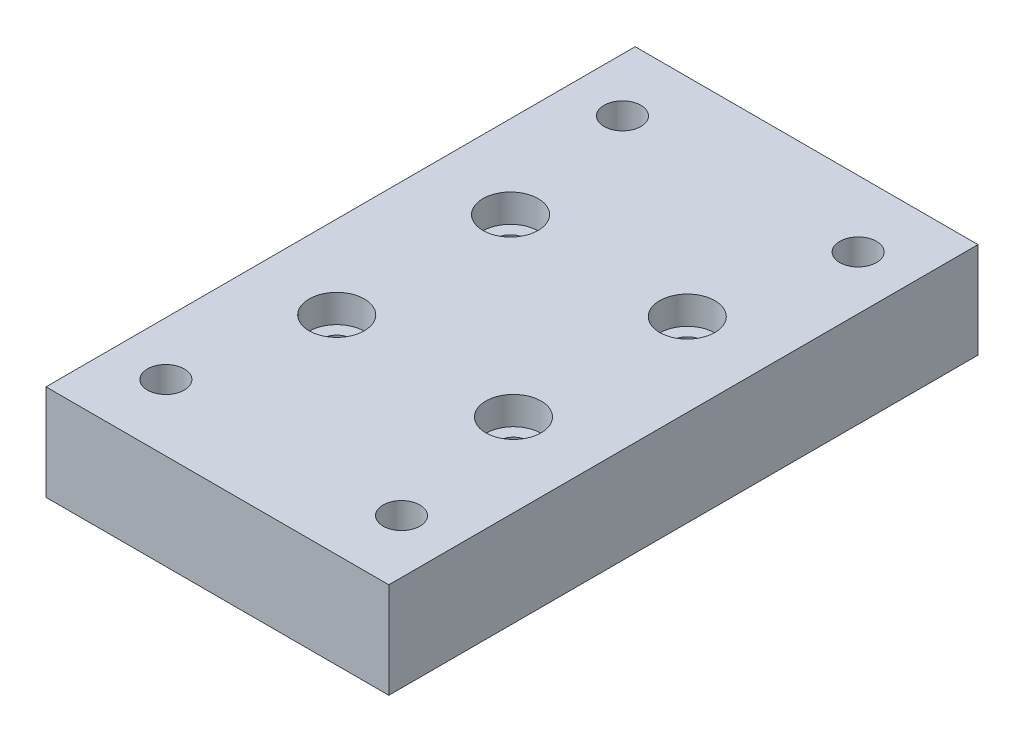
ISO-10303-21;
HEADER;
FILE_DESCRIPTION(('STEP AP214'),'2;1');
FILE_NAME('part.step','',(''),(''),'','','');
FILE_SCHEMA(('AUTOMOTIVE_DESIGN { 1 0 10303 214 1 1 1 1 }'));
ENDSEC;
DATA;
#1=APPLICATION_CONTEXT('core data for automotive mechanical design processes');
#2=APPLICATION_PROTOCOL_DEFINITION('international standard','automotive_design',2000,#1);
#3=PRODUCT_CONTEXT('',#1,'mechanical');
#4=PRODUCT('Part','Part','',(#3));
#5=PRODUCT_RELATED_PRODUCT_CATEGORY('part','',(#4));
#6=PRODUCT_DEFINITION_FORMATION('','',#4);
#7=PRODUCT_DEFINITION_CONTEXT('part definition',#1,'design');
#8=PRODUCT_DEFINITION('design','',#6,#7);
#9=PRODUCT_DEFINITION_SHAPE('','',#8);
#10=(LENGTH_UNIT() NAMED_UNIT(*) SI_UNIT(.MILLI.,.METRE.));
#11=(NAMED_UNIT(*) PLANE_ANGLE_UNIT() SI_UNIT($,.RADIAN.));
#12=(NAMED_UNIT(*) SI_UNIT($,.STERADIAN.) SOLID_ANGLE_UNIT());
#13=UNCERTAINTY_MEASURE_WITH_UNIT(LENGTH_MEASURE(1.E-05),#10,'distance_accuracy_value','');
#14=(GEOMETRIC_REPRESENTATION_CONTEXT(3) GLOBAL_UNCERTAINTY_ASSIGNED_CONTEXT((#13)) GLOBAL_UNIT_ASSIGNED_CONTEXT((#10,
#11,#12)) REPRESENTATION_CONTEXT('',''));
#15=CARTESIAN_POINT('',(0.,0.,0.));
#16=DIRECTION('',(0.,0.,1.));
#17=DIRECTION('',(1.,0.,0.));
#18=AXIS2_PLACEMENT_3D('',#15,#16,#17);
#19=CARTESIAN_POINT('',(29.55925,16.51,50.8));
#20=DIRECTION('',(-1.,0.,0.));
#21=DIRECTION('',(0.,0.,1.));
#22=AXIS2_PLACEMENT_3D('',#19,#20,#21);
#23=PLANE('',#22);
#24=DIRECTION('',(0.,0.,-1.));
#25=VECTOR('',#24,1.);
#26=CARTESIAN_POINT('',(29.55925,0.,50.8));
#27=LINE('',#26,#25);
#28=CARTESIAN_POINT('',(29.55925,0.,50.8));
#29=VERTEX_POINT('',#28);
#30=CARTESIAN_POINT('',(29.55925,0.,-50.8));
#31=VERTEX_POINT('',#30);
#32=EDGE_CURVE('E96',#29,#31,#27,.T.);
#33=ORIENTED_EDGE('',*,*,#32,.T.);
#34=DIRECTION('',(0.,-1.,0.));
#35=VECTOR('',#34,1.);
#36=CARTESIAN_POINT('',(29.55925,16.51,-50.8));
#37=LINE('',#36,#35);
#38=CARTESIAN_POINT('',(29.55925,16.51,-50.8));
#39=VERTEX_POINT('',#38);
#40=EDGE_CURVE('E11',#39,#31,#37,.T.);
#41=ORIENTED_EDGE('',*,*,#40,.F.);
#42=DIRECTION('',(0.,0.,-1.));
#43=VECTOR('',#42,1.);
#44=CARTESIAN_POINT('',(29.55925,16.51,50.8));
#45=LINE('',#44,#43);
#46=CARTESIAN_POINT('',(29.55925,16.51,50.8));
#47=VERTEX_POINT('',#46);
#48=EDGE_CURVE('E84',#47,#39,#45,.T.);
#49=ORIENTED_EDGE('',*,*,#48,.F.);
#50=DIRECTION('',(0.,-1.,0.));
#51=VECTOR('',#50,1.);
#52=CARTESIAN_POINT('',(29.55925,16.51,50.8));
#53=LINE('',#52,#51);
#54=EDGE_CURVE('E92',#47,#29,#53,.T.);
#55=ORIENTED_EDGE('',*,*,#54,.T.);
#56=EDGE_LOOP('',(#33,#41,#49,#55));
#57=FACE_BOUND('',#56,.T.);
#58=ADVANCED_FACE('F33',(#57),#23,.F.);
#59=CARTESIAN_POINT('',(-29.55925,16.51,-50.8));
#60=DIRECTION('',(0.,0.,1.));
#61=DIRECTION('',(1.,0.,0.));
#62=AXIS2_PLACEMENT_3D('',#59,#60,#61);
#63=PLANE('',#62);
#64=DIRECTION('',(-1.,0.,0.));
#65=VECTOR('',#64,1.);
#66=CARTESIAN_POINT('',(-29.55925,0.,-50.8));
#67=LINE('',#66,#65);
#68=CARTESIAN_POINT('',(-29.55925,0.,-50.8));
#69=VERTEX_POINT('',#68);
#70=EDGE_CURVE('E88',#31,#69,#67,.T.);
#71=ORIENTED_EDGE('',*,*,#70,.T.);
#72=DIRECTION('',(0.,-1.,0.));
#73=VECTOR('',#72,1.);
#74=CARTESIAN_POINT('',(-29.55925,16.51,-50.8));
#75=LINE('',#74,#73);
#76=CARTESIAN_POINT('',(-29.55925,16.51,-50.8));
#77=VERTEX_POINT('',#76);
#78=EDGE_CURVE('E41',#77,#69,#75,.T.);
#79=ORIENTED_EDGE('',*,*,#78,.F.);
#80=DIRECTION('',(-1.,0.,0.));
#81=VECTOR('',#80,1.);
#82=CARTESIAN_POINT('',(-29.55925,16.51,-50.8));
#83=LINE('',#82,#81);
#84=EDGE_CURVE('E79',#39,#77,#83,.T.);
#85=ORIENTED_EDGE('',*,*,#84,.F.);
#86=ORIENTED_EDGE('',*,*,#40,.T.);
#87=EDGE_LOOP('',(#71,#79,#85,#86));
#88=FACE_BOUND('',#87,.T.);
#89=ADVANCED_FACE('F87',(#88),#63,.F.);
#90=CARTESIAN_POINT('',(-29.55925,16.51,50.8));
#91=DIRECTION('',(1.,0.,0.));
#92=DIRECTION('',(0.,0.,-1.));
#93=AXIS2_PLACEMENT_3D('',#90,#91,#92);
#94=PLANE('',#93);
#95=DIRECTION('',(0.,0.,1.));
#96=VECTOR('',#95,1.);
#97=CARTESIAN_POINT('',(-29.55925,0.,50.8));
#98=LINE('',#97,#96);
#99=CARTESIAN_POINT('',(-29.55925,0.,50.8));
#100=VERTEX_POINT('',#99);
#101=EDGE_CURVE('E66',#69,#100,#98,.T.);
#102=ORIENTED_EDGE('',*,*,#101,.T.);
#103=DIRECTION('',(0.,-1.,0.));
#104=VECTOR('',#103,1.);
#105=CARTESIAN_POINT('',(-29.55925,16.51,50.8));
#106=LINE('',#105,#104);
#107=CARTESIAN_POINT('',(-29.55925,16.51,50.8));
#108=VERTEX_POINT('',#107);
#109=EDGE_CURVE('E89',#108,#100,#106,.T.);
#110=ORIENTED_EDGE('',*,*,#109,.F.);
#111=DIRECTION('',(0.,0.,1.));
#112=VECTOR('',#111,1.);
#113=CARTESIAN_POINT('',(-29.55925,16.51,50.8));
#114=LINE('',#113,#112);
#115=EDGE_CURVE('E82',#77,#108,#114,.T.);
#116=ORIENTED_EDGE('',*,*,#115,.F.);
#117=ORIENTED_EDGE('',*,*,#78,.T.);
#118=EDGE_LOOP('',(#102,#110,#116,#117));
#119=FACE_BOUND('',#118,.T.);
#120=ADVANCED_FACE('F90',(#119),#94,.F.);
#121=CARTESIAN_POINT('',(-29.55925,16.51,50.8));
#122=DIRECTION('',(0.,0.,-1.));
#123=DIRECTION('',(-1.,0.,0.));
#124=AXIS2_PLACEMENT_3D('',#121,#122,#123);
#125=PLANE('',#124);
#126=DIRECTION('',(1.,0.,0.));
#127=VECTOR('',#126,1.);
#128=CARTESIAN_POINT('',(-29.55925,0.,50.8));
#129=LINE('',#128,#127);
#130=EDGE_CURVE('E72',#100,#29,#129,.T.);
#131=ORIENTED_EDGE('',*,*,#130,.T.);
#132=ORIENTED_EDGE('',*,*,#54,.F.);
#133=DIRECTION('',(1.,0.,0.));
#134=VECTOR('',#133,1.);
#135=CARTESIAN_POINT('',(-29.55925,16.51,50.8));
#136=LINE('',#135,#134);
#137=EDGE_CURVE('E49',#108,#47,#136,.T.);
#138=ORIENTED_EDGE('',*,*,#137,.F.);
#139=ORIENTED_EDGE('',*,*,#109,.T.);
#140=EDGE_LOOP('',(#131,#132,#138,#139));
#141=FACE_BOUND('',#140,.T.);
#142=ADVANCED_FACE('F104',(#141),#125,.F.);
#143=CARTESIAN_POINT('',(0.,16.51,0.));
#144=DIRECTION('',(0.,-1.,0.));
#145=DIRECTION('',(0.,0.,-1.));
#146=AXIS2_PLACEMENT_3D('',#143,#144,#145);
#147=PLANE('',#146);
#148=CARTESIAN_POINT('',(20.32,16.51,39.37));
#149=DIRECTION('',(0.,1.,0.));
#150=DIRECTION('',(0.,0.,1.));
#151=AXIS2_PLACEMENT_3D('',#148,#149,#150);
#152=CIRCLE('',#151,3.175);
#153=CARTESIAN_POINT('',(20.32,16.51,42.545));
#154=VERTEX_POINT('',#153);
#155=EDGE_CURVE('E178',#154,#154,#152,.T.);
#156=ORIENTED_EDGE('',*,*,#155,.F.);
#157=EDGE_LOOP('',(#156));
#158=FACE_BOUND('',#157,.T.);
#159=CARTESIAN_POINT('',(-20.32,16.51,39.37));
#160=DIRECTION('',(0.,1.,0.));
#161=DIRECTION('',(0.,0.,1.));
#162=AXIS2_PLACEMENT_3D('',#159,#160,#161);
#163=CIRCLE('',#162,3.175);
#164=CARTESIAN_POINT('',(-20.32,16.51,42.545));
#165=VERTEX_POINT('',#164);
#166=EDGE_CURVE('E172',#165,#165,#163,.T.);
#167=ORIENTED_EDGE('',*,*,#166,.F.);
#168=EDGE_LOOP('',(#167));
#169=FACE_BOUND('',#168,.T.);
#170=CARTESIAN_POINT('',(-20.32,16.51,-39.37));
#171=DIRECTION('',(0.,1.,0.));
#172=DIRECTION('',(0.,0.,1.));
#173=AXIS2_PLACEMENT_3D('',#170,#171,#172);
#174=CIRCLE('',#173,3.175);
#175=CARTESIAN_POINT('',(-20.32,16.51,-36.195));
#176=VERTEX_POINT('',#175);
#177=EDGE_CURVE('E166',#176,#176,#174,.T.);
#178=ORIENTED_EDGE('',*,*,#177,.F.);
#179=EDGE_LOOP('',(#178));
#180=FACE_BOUND('',#179,.T.);
#181=CARTESIAN_POINT('',(20.32,16.51,-39.37));
#182=DIRECTION('',(0.,1.,0.));
#183=DIRECTION('',(0.,0.,1.));
#184=AXIS2_PLACEMENT_3D('',#181,#182,#183);
#185=CIRCLE('',#184,3.175);
#186=CARTESIAN_POINT('',(20.32,16.51,-36.195));
#187=VERTEX_POINT('',#186);
#188=EDGE_CURVE('E160',#187,#187,#185,.T.);
#189=ORIENTED_EDGE('',*,*,#188,.F.);
#190=EDGE_LOOP('',(#189));
#191=FACE_BOUND('',#190,.T.);
#192=CARTESIAN_POINT('',(-15.24,16.5100000000001,-14.9860000000001));
#193=DIRECTION('',(0.,1.,0.));
#194=DIRECTION('',(0.,0.,1.));
#195=AXIS2_PLACEMENT_3D('',#192,#193,#194);
#196=CIRCLE('',#195,4.76249999999999);
#197=CARTESIAN_POINT('',(-15.24,16.5100000000001,-10.2235000000001));
#198=VERTEX_POINT('',#197);
#199=EDGE_CURVE('E154',#198,#198,#196,.T.);
#200=ORIENTED_EDGE('',*,*,#199,.F.);
#201=EDGE_LOOP('',(#200));
#202=FACE_BOUND('',#201,.T.);
#203=CARTESIAN_POINT('',(-15.24,16.5100000000001,14.986));
#204=DIRECTION('',(0.,1.,0.));
#205=DIRECTION('',(0.,0.,1.));
#206=AXIS2_PLACEMENT_3D('',#203,#204,#205);
#207=CIRCLE('',#206,4.76249999999999);
#208=CARTESIAN_POINT('',(-15.24,16.5100000000001,19.7484999999999));
#209=VERTEX_POINT('',#208);
#210=EDGE_CURVE('E142',#209,#209,#207,.T.);
#211=ORIENTED_EDGE('',*,*,#210,.F.);
#212=EDGE_LOOP('',(#211));
#213=FACE_BOUND('',#212,.T.);
#214=CARTESIAN_POINT('',(15.24,16.5100000000001,14.986));
#215=DIRECTION('',(0.,1.,0.));
#216=DIRECTION('',(0.,0.,1.));
#217=AXIS2_PLACEMENT_3D('',#214,#215,#216);
#218=CIRCLE('',#217,4.76249999999999);
#219=CARTESIAN_POINT('',(15.24,16.5100000000001,19.7484999999999));
#220=VERTEX_POINT('',#219);
#221=EDGE_CURVE('E130',#220,#220,#218,.T.);
#222=ORIENTED_EDGE('',*,*,#221,.F.);
#223=EDGE_LOOP('',(#222));
#224=FACE_BOUND('',#223,.T.);
#225=CARTESIAN_POINT('',(15.24,16.5100000000001,-14.9860000000001));
#226=DIRECTION('',(0.,1.,0.));
#227=DIRECTION('',(0.,0.,1.));
#228=AXIS2_PLACEMENT_3D('',#225,#226,#227);
#229=CIRCLE('',#228,4.76249999999999);
#230=CARTESIAN_POINT('',(15.24,16.5100000000001,-10.2235000000001));
#231=VERTEX_POINT('',#230);
#232=EDGE_CURVE('E118',#231,#231,#229,.T.);
#233=ORIENTED_EDGE('',*,*,#232,.F.);
#234=EDGE_LOOP('',(#233));
#235=FACE_BOUND('',#234,.T.);
#236=ORIENTED_EDGE('',*,*,#48,.T.);
#237=ORIENTED_EDGE('',*,*,#84,.T.);
#238=ORIENTED_EDGE('',*,*,#115,.T.);
#239=ORIENTED_EDGE('',*,*,#137,.T.);
#240=EDGE_LOOP('',(#236,#237,#238,#239));
#241=FACE_BOUND('',#240,.T.);
#242=ADVANCED_FACE('F80',(#158,#169,#180,#191,#202,#213,#224,#235,#241),#147,.F.);
#243=CARTESIAN_POINT('',(0.,0.,0.));
#244=DIRECTION('',(0.,-1.,0.));
#245=DIRECTION('',(0.,0.,-1.));
#246=AXIS2_PLACEMENT_3D('',#243,#244,#245);
#247=PLANE('',#246);
#248=CARTESIAN_POINT('',(20.32,0.,39.37));
#249=DIRECTION('',(0.,1.,0.));
#250=DIRECTION('',(0.,0.,1.));
#251=AXIS2_PLACEMENT_3D('',#248,#249,#250);
#252=CIRCLE('',#251,3.175);
#253=CARTESIAN_POINT('',(20.32,0.,42.545));
#254=VERTEX_POINT('',#253);
#255=EDGE_CURVE('E175',#254,#254,#252,.T.);
#256=ORIENTED_EDGE('',*,*,#255,.T.);
#257=EDGE_LOOP('',(#256));
#258=FACE_BOUND('',#257,.T.);
#259=CARTESIAN_POINT('',(-20.32,0.,39.37));
#260=DIRECTION('',(0.,1.,0.));
#261=DIRECTION('',(0.,0.,1.));
#262=AXIS2_PLACEMENT_3D('',#259,#260,#261);
#263=CIRCLE('',#262,3.175);
#264=CARTESIAN_POINT('',(-20.32,0.,42.545));
#265=VERTEX_POINT('',#264);
#266=EDGE_CURVE('E169',#265,#265,#263,.T.);
#267=ORIENTED_EDGE('',*,*,#266,.T.);
#268=EDGE_LOOP('',(#267));
#269=FACE_BOUND('',#268,.T.);
#270=CARTESIAN_POINT('',(-20.32,0.,-39.37));
#271=DIRECTION('',(0.,1.,0.));
#272=DIRECTION('',(0.,0.,1.));
#273=AXIS2_PLACEMENT_3D('',#270,#271,#272);
#274=CIRCLE('',#273,3.175);
#275=CARTESIAN_POINT('',(-20.32,0.,-36.195));
#276=VERTEX_POINT('',#275);
#277=EDGE_CURVE('E163',#276,#276,#274,.T.);
#278=ORIENTED_EDGE('',*,*,#277,.T.);
#279=EDGE_LOOP('',(#278));
#280=FACE_BOUND('',#279,.T.);
#281=CARTESIAN_POINT('',(20.32,0.,-39.37));
#282=DIRECTION('',(0.,1.,0.));
#283=DIRECTION('',(0.,0.,1.));
#284=AXIS2_PLACEMENT_3D('',#281,#282,#283);
#285=CIRCLE('',#284,3.175);
#286=CARTESIAN_POINT('',(20.32,0.,-36.195));
#287=VERTEX_POINT('',#286);
#288=EDGE_CURVE('E157',#287,#287,#285,.T.);
#289=ORIENTED_EDGE('',*,*,#288,.T.);
#290=EDGE_LOOP('',(#289));
#291=FACE_BOUND('',#290,.T.);
#292=ORIENTED_EDGE('',*,*,#32,.F.);
#293=ORIENTED_EDGE('',*,*,#130,.F.);
#294=ORIENTED_EDGE('',*,*,#101,.F.);
#295=ORIENTED_EDGE('',*,*,#70,.F.);
#296=EDGE_LOOP('',(#292,#293,#294,#295));
#297=FACE_BOUND('',#296,.T.);
#298=ADVANCED_FACE('F107',(#258,#269,#280,#291,#297),#247,.T.);
#299=CARTESIAN_POINT('',(15.24,1.27,-14.9860000000001));
#300=DIRECTION('',(0.,-1.,0.));
#301=DIRECTION('',(0.,0.,-1.));
#302=AXIS2_PLACEMENT_3D('',#299,#300,#301);
#303=PLANE('',#302);
#304=CARTESIAN_POINT('',(15.24,1.27,-14.9860000000001));
#305=DIRECTION('',(0.,1.,0.));
#306=DIRECTION('',(0.,0.,1.));
#307=AXIS2_PLACEMENT_3D('',#304,#305,#306);
#308=CIRCLE('',#307,2.55270000000001);
#309=CARTESIAN_POINT('',(15.24,1.27,-12.4333));
#310=VERTEX_POINT('',#309);
#311=EDGE_CURVE('E99',#310,#310,#308,.T.);
#312=ORIENTED_EDGE('',*,*,#311,.T.);
#313=EDGE_LOOP('',(#312));
#314=FACE_BOUND('',#313,.T.);
#315=ADVANCED_FACE('F230',(#314),#303,.F.);
#316=CARTESIAN_POINT('',(15.24,16.5100000000001,-14.9860000000001));
#317=DIRECTION('',(0.,1.,0.));
#318=DIRECTION('',(0.,0.,1.));
#319=AXIS2_PLACEMENT_3D('',#316,#317,#318);
#320=CYLINDRICAL_SURFACE('',#319,2.55270000000001);
#321=ORIENTED_EDGE('',*,*,#311,.F.);
#322=EDGE_LOOP('',(#321));
#323=FACE_BOUND('',#322,.T.);
#324=CARTESIAN_POINT('',(15.24,11.6840000000001,-14.9860000000001));
#325=DIRECTION('',(0.,1.,0.));
#326=DIRECTION('',(0.,0.,1.));
#327=AXIS2_PLACEMENT_3D('',#324,#325,#326);
#328=CIRCLE('',#327,2.55270000000001);
#329=CARTESIAN_POINT('',(15.24,11.6840000000001,-12.4333));
#330=VERTEX_POINT('',#329);
#331=EDGE_CURVE('E112',#330,#330,#328,.T.);
#332=ORIENTED_EDGE('',*,*,#331,.T.);
#333=EDGE_LOOP('',(#332));
#334=FACE_BOUND('',#333,.T.);
#335=ADVANCED_FACE('F214',(#323,#334),#320,.F.);
#336=CARTESIAN_POINT('',(17.7927,11.6840000000001,-14.9860000000001));
#337=DIRECTION('',(0.,-1.,0.));
#338=DIRECTION('',(0.,0.,-1.));
#339=AXIS2_PLACEMENT_3D('',#336,#337,#338);
#340=PLANE('',#339);
#341=ORIENTED_EDGE('',*,*,#331,.F.);
#342=EDGE_LOOP('',(#341));
#343=FACE_BOUND('',#342,.T.);
#344=CARTESIAN_POINT('',(15.24,11.6840000000001,-14.9860000000001));
#345=DIRECTION('',(0.,1.,0.));
#346=DIRECTION('',(0.,0.,1.));
#347=AXIS2_PLACEMENT_3D('',#344,#345,#346);
#348=CIRCLE('',#347,4.7625);
#349=CARTESIAN_POINT('',(15.24,11.6840000000001,-10.2235000000001));
#350=VERTEX_POINT('',#349);
#351=EDGE_CURVE('E115',#350,#350,#348,.T.);
#352=ORIENTED_EDGE('',*,*,#351,.T.);
#353=EDGE_LOOP('',(#352));
#354=FACE_BOUND('',#353,.T.);
#355=ADVANCED_FACE('F204',(#343,#354),#340,.F.);
#356=CARTESIAN_POINT('',(15.24,16.5100000000001,-14.9860000000001));
#357=DIRECTION('',(0.,1.,0.));
#358=DIRECTION('',(0.,0.,1.));
#359=AXIS2_PLACEMENT_3D('',#356,#357,#358);
#360=CYLINDRICAL_SURFACE('',#359,4.76249999999999);
#361=ORIENTED_EDGE('',*,*,#351,.F.);
#362=EDGE_LOOP('',(#361));
#363=FACE_BOUND('',#362,.T.);
#364=ORIENTED_EDGE('',*,*,#232,.T.);
#365=EDGE_LOOP('',(#364));
#366=FACE_BOUND('',#365,.T.);
#367=ADVANCED_FACE('F201',(#363,#366),#360,.F.);
#368=CARTESIAN_POINT('',(15.24,1.27,14.986));
#369=DIRECTION('',(0.,-1.,0.));
#370=DIRECTION('',(0.,0.,-1.));
#371=AXIS2_PLACEMENT_3D('',#368,#369,#370);
#372=PLANE('',#371);
#373=CARTESIAN_POINT('',(15.24,1.27,14.986));
#374=DIRECTION('',(0.,1.,0.));
#375=DIRECTION('',(0.,0.,1.));
#376=AXIS2_PLACEMENT_3D('',#373,#374,#375);
#377=CIRCLE('',#376,2.55270000000001);
#378=CARTESIAN_POINT('',(15.24,1.27,17.5387));
#379=VERTEX_POINT('',#378);
#380=EDGE_CURVE('E121',#379,#379,#377,.T.);
#381=ORIENTED_EDGE('',*,*,#380,.T.);
#382=EDGE_LOOP('',(#381));
#383=FACE_BOUND('',#382,.T.);
#384=ADVANCED_FACE('F203',(#383),#372,.F.);
#385=CARTESIAN_POINT('',(15.24,16.5100000000001,14.986));
#386=DIRECTION('',(0.,1.,0.));
#387=DIRECTION('',(0.,0.,1.));
#388=AXIS2_PLACEMENT_3D('',#385,#386,#387);
#389=CYLINDRICAL_SURFACE('',#388,2.55270000000001);
#390=ORIENTED_EDGE('',*,*,#380,.F.);
#391=EDGE_LOOP('',(#390));
#392=FACE_BOUND('',#391,.T.);
#393=CARTESIAN_POINT('',(15.24,11.6840000000001,14.986));
#394=DIRECTION('',(0.,1.,0.));
#395=DIRECTION('',(0.,0.,1.));
#396=AXIS2_PLACEMENT_3D('',#393,#394,#395);
#397=CIRCLE('',#396,2.55270000000001);
#398=CARTESIAN_POINT('',(15.24,11.6840000000001,17.5387));
#399=VERTEX_POINT('',#398);
#400=EDGE_CURVE('E124',#399,#399,#397,.T.);
#401=ORIENTED_EDGE('',*,*,#400,.T.);
#402=EDGE_LOOP('',(#401));
#403=FACE_BOUND('',#402,.T.);
#404=ADVANCED_FACE('F211',(#392,#403),#389,.F.);
#405=CARTESIAN_POINT('',(17.7927,11.6840000000001,14.986));
#406=DIRECTION('',(0.,-1.,0.));
#407=DIRECTION('',(0.,0.,-1.));
#408=AXIS2_PLACEMENT_3D('',#405,#406,#407);
#409=PLANE('',#408);
#410=ORIENTED_EDGE('',*,*,#400,.F.);
#411=EDGE_LOOP('',(#410));
#412=FACE_BOUND('',#411,.T.);
#413=CARTESIAN_POINT('',(15.24,11.6840000000001,14.986));
#414=DIRECTION('',(0.,1.,0.));
#415=DIRECTION('',(0.,0.,1.));
#416=AXIS2_PLACEMENT_3D('',#413,#414,#415);
#417=CIRCLE('',#416,4.7625);
#418=CARTESIAN_POINT('',(15.24,11.6840000000001,19.7485));
#419=VERTEX_POINT('',#418);
#420=EDGE_CURVE('E127',#419,#419,#417,.T.);
#421=ORIENTED_EDGE('',*,*,#420,.T.);
#422=EDGE_LOOP('',(#421));
#423=FACE_BOUND('',#422,.T.);
#424=ADVANCED_FACE('F269',(#412,#423),#409,.F.);
#425=CARTESIAN_POINT('',(15.24,16.5100000000001,14.986));
#426=DIRECTION('',(0.,1.,0.));
#427=DIRECTION('',(0.,0.,1.));
#428=AXIS2_PLACEMENT_3D('',#425,#426,#427);
#429=CYLINDRICAL_SURFACE('',#428,4.76249999999999);
#430=ORIENTED_EDGE('',*,*,#420,.F.);
#431=EDGE_LOOP('',(#430));
#432=FACE_BOUND('',#431,.T.);
#433=ORIENTED_EDGE('',*,*,#221,.T.);
#434=EDGE_LOOP('',(#433));
#435=FACE_BOUND('',#434,.T.);
#436=ADVANCED_FACE('F279',(#432,#435),#429,.F.);
#437=CARTESIAN_POINT('',(-15.24,1.27,14.986));
#438=DIRECTION('',(0.,-1.,0.));
#439=DIRECTION('',(0.,0.,-1.));
#440=AXIS2_PLACEMENT_3D('',#437,#438,#439);
#441=PLANE('',#440);
#442=CARTESIAN_POINT('',(-15.24,1.27,14.986));
#443=DIRECTION('',(0.,1.,0.));
#444=DIRECTION('',(0.,0.,1.));
#445=AXIS2_PLACEMENT_3D('',#442,#443,#444);
#446=CIRCLE('',#445,2.55270000000001);
#447=CARTESIAN_POINT('',(-15.24,1.27,17.5387));
#448=VERTEX_POINT('',#447);
#449=EDGE_CURVE('E133',#448,#448,#446,.T.);
#450=ORIENTED_EDGE('',*,*,#449,.T.);
#451=EDGE_LOOP('',(#450));
#452=FACE_BOUND('',#451,.T.);
#453=ADVANCED_FACE('F289',(#452),#441,.F.);
#454=CARTESIAN_POINT('',(-15.24,16.5100000000001,14.986));
#455=DIRECTION('',(0.,1.,0.));
#456=DIRECTION('',(0.,0.,1.));
#457=AXIS2_PLACEMENT_3D('',#454,#455,#456);
#458=CYLINDRICAL_SURFACE('',#457,2.55270000000001);
#459=ORIENTED_EDGE('',*,*,#449,.F.);
#460=EDGE_LOOP('',(#459));
#461=FACE_BOUND('',#460,.T.);
#462=CARTESIAN_POINT('',(-15.24,11.6840000000001,14.986));
#463=DIRECTION('',(0.,1.,0.));
#464=DIRECTION('',(0.,0.,1.));
#465=AXIS2_PLACEMENT_3D('',#462,#463,#464);
#466=CIRCLE('',#465,2.55270000000001);
#467=CARTESIAN_POINT('',(-15.24,11.6840000000001,17.5387));
#468=VERTEX_POINT('',#467);
#469=EDGE_CURVE('E136',#468,#468,#466,.T.);
#470=ORIENTED_EDGE('',*,*,#469,.T.);
#471=EDGE_LOOP('',(#470));
#472=FACE_BOUND('',#471,.T.);
#473=ADVANCED_FACE('F299',(#461,#472),#458,.F.);
#474=CARTESIAN_POINT('',(-12.6873,11.6840000000001,14.986));
#475=DIRECTION('',(0.,-1.,0.));
#476=DIRECTION('',(0.,0.,-1.));
#477=AXIS2_PLACEMENT_3D('',#474,#475,#476);
#478=PLANE('',#477);
#479=ORIENTED_EDGE('',*,*,#469,.F.);
#480=EDGE_LOOP('',(#479));
#481=FACE_BOUND('',#480,.T.);
#482=CARTESIAN_POINT('',(-15.24,11.6840000000001,14.986));
#483=DIRECTION('',(0.,1.,0.));
#484=DIRECTION('',(0.,0.,1.));
#485=AXIS2_PLACEMENT_3D('',#482,#483,#484);
#486=CIRCLE('',#485,4.7625);
#487=CARTESIAN_POINT('',(-15.24,11.6840000000001,19.7485));
#488=VERTEX_POINT('',#487);
#489=EDGE_CURVE('E139',#488,#488,#486,.T.);
#490=ORIENTED_EDGE('',*,*,#489,.T.);
#491=EDGE_LOOP('',(#490));
#492=FACE_BOUND('',#491,.T.);
#493=ADVANCED_FACE('F309',(#481,#492),#478,.F.);
#494=CARTESIAN_POINT('',(-15.24,16.5100000000001,14.986));
#495=DIRECTION('',(0.,1.,0.));
#496=DIRECTION('',(0.,0.,1.));
#497=AXIS2_PLACEMENT_3D('',#494,#495,#496);
#498=CYLINDRICAL_SURFACE('',#497,4.76249999999999);
#499=ORIENTED_EDGE('',*,*,#489,.F.);
#500=EDGE_LOOP('',(#499));
#501=FACE_BOUND('',#500,.T.);
#502=ORIENTED_EDGE('',*,*,#210,.T.);
#503=EDGE_LOOP('',(#502));
#504=FACE_BOUND('',#503,.T.);
#505=ADVANCED_FACE('F319',(#501,#504),#498,.F.);
#506=CARTESIAN_POINT('',(-15.24,1.27,-14.9860000000001));
#507=DIRECTION('',(0.,-1.,0.));
#508=DIRECTION('',(0.,0.,-1.));
#509=AXIS2_PLACEMENT_3D('',#506,#507,#508);
#510=PLANE('',#509);
#511=CARTESIAN_POINT('',(-15.24,1.27,-14.9860000000001));
#512=DIRECTION('',(0.,1.,0.));
#513=DIRECTION('',(0.,0.,1.));
#514=AXIS2_PLACEMENT_3D('',#511,#512,#513);
#515=CIRCLE('',#514,2.55270000000001);
#516=CARTESIAN_POINT('',(-15.24,1.27,-12.4333));
#517=VERTEX_POINT('',#516);
#518=EDGE_CURVE('E145',#517,#517,#515,.T.);
#519=ORIENTED_EDGE('',*,*,#518,.T.);
#520=EDGE_LOOP('',(#519));
#521=FACE_BOUND('',#520,.T.);
#522=ADVANCED_FACE('F329',(#521),#510,.F.);
#523=CARTESIAN_POINT('',(-15.24,16.5100000000001,-14.9860000000001));
#524=DIRECTION('',(0.,1.,0.));
#525=DIRECTION('',(0.,0.,1.));
#526=AXIS2_PLACEMENT_3D('',#523,#524,#525);
#527=CYLINDRICAL_SURFACE('',#526,2.55270000000001);
#528=ORIENTED_EDGE('',*,*,#518,.F.);
#529=EDGE_LOOP('',(#528));
#530=FACE_BOUND('',#529,.T.);
#531=CARTESIAN_POINT('',(-15.24,11.6840000000001,-14.9860000000001));
#532=DIRECTION('',(0.,1.,0.));
#533=DIRECTION('',(0.,0.,1.));
#534=AXIS2_PLACEMENT_3D('',#531,#532,#533);
#535=CIRCLE('',#534,2.55270000000001);
#536=CARTESIAN_POINT('',(-15.24,11.6840000000001,-12.4333));
#537=VERTEX_POINT('',#536);
#538=EDGE_CURVE('E148',#537,#537,#535,.T.);
#539=ORIENTED_EDGE('',*,*,#538,.T.);
#540=EDGE_LOOP('',(#539));
#541=FACE_BOUND('',#540,.T.);
#542=ADVANCED_FACE('F339',(#530,#541),#527,.F.);
#543=CARTESIAN_POINT('',(-12.6873,11.6840000000001,-14.9860000000001));
#544=DIRECTION('',(0.,-1.,0.));
#545=DIRECTION('',(0.,0.,-1.));
#546=AXIS2_PLACEMENT_3D('',#543,#544,#545);
#547=PLANE('',#546);
#548=ORIENTED_EDGE('',*,*,#538,.F.);
#549=EDGE_LOOP('',(#548));
#550=FACE_BOUND('',#549,.T.);
#551=CARTESIAN_POINT('',(-15.24,11.6840000000001,-14.9860000000001));
#552=DIRECTION('',(0.,1.,0.));
#553=DIRECTION('',(0.,0.,1.));
#554=AXIS2_PLACEMENT_3D('',#551,#552,#553);
#555=CIRCLE('',#554,4.7625);
#556=CARTESIAN_POINT('',(-15.24,11.6840000000001,-10.2235000000001));
#557=VERTEX_POINT('',#556);
#558=EDGE_CURVE('E151',#557,#557,#555,.T.);
#559=ORIENTED_EDGE('',*,*,#558,.T.);
#560=EDGE_LOOP('',(#559));
#561=FACE_BOUND('',#560,.T.);
#562=ADVANCED_FACE('F349',(#550,#561),#547,.F.);
#563=CARTESIAN_POINT('',(-15.24,16.5100000000001,-14.9860000000001));
#564=DIRECTION('',(0.,1.,0.));
#565=DIRECTION('',(0.,0.,1.));
#566=AXIS2_PLACEMENT_3D('',#563,#564,#565);
#567=CYLINDRICAL_SURFACE('',#566,4.76249999999999);
#568=ORIENTED_EDGE('',*,*,#558,.F.);
#569=EDGE_LOOP('',(#568));
#570=FACE_BOUND('',#569,.T.);
#571=ORIENTED_EDGE('',*,*,#199,.T.);
#572=EDGE_LOOP('',(#571));
#573=FACE_BOUND('',#572,.T.);
#574=ADVANCED_FACE('F359',(#570,#573),#567,.F.);
#575=CARTESIAN_POINT('',(20.32,16.51,-39.37));
#576=DIRECTION('',(0.,1.,0.));
#577=DIRECTION('',(0.,0.,1.));
#578=AXIS2_PLACEMENT_3D('',#575,#576,#577);
#579=CYLINDRICAL_SURFACE('',#578,3.175);
#580=ORIENTED_EDGE('',*,*,#288,.F.);
#581=EDGE_LOOP('',(#580));
#582=FACE_BOUND('',#581,.T.);
#583=ORIENTED_EDGE('',*,*,#188,.T.);
#584=EDGE_LOOP('',(#583));
#585=FACE_BOUND('',#584,.T.);
#586=ADVANCED_FACE('F369',(#582,#585),#579,.F.);
#587=CARTESIAN_POINT('',(-20.32,16.51,-39.37));
#588=DIRECTION('',(0.,1.,0.));
#589=DIRECTION('',(0.,0.,1.));
#590=AXIS2_PLACEMENT_3D('',#587,#588,#589);
#591=CYLINDRICAL_SURFACE('',#590,3.175);
#592=ORIENTED_EDGE('',*,*,#277,.F.);
#593=EDGE_LOOP('',(#592));
#594=FACE_BOUND('',#593,.T.);
#595=ORIENTED_EDGE('',*,*,#177,.T.);
#596=EDGE_LOOP('',(#595));
#597=FACE_BOUND('',#596,.T.);
#598=ADVANCED_FACE('F393',(#594,#597),#591,.F.);
#599=CARTESIAN_POINT('',(-20.32,16.51,39.37));
#600=DIRECTION('',(0.,1.,0.));
#601=DIRECTION('',(0.,0.,1.));
#602=AXIS2_PLACEMENT_3D('',#599,#600,#601);
#603=CYLINDRICAL_SURFACE('',#602,3.175);
#604=ORIENTED_EDGE('',*,*,#266,.F.);
#605=EDGE_LOOP('',(#604));
#606=FACE_BOUND('',#605,.T.);
#607=ORIENTED_EDGE('',*,*,#166,.T.);
#608=EDGE_LOOP('',(#607));
#609=FACE_BOUND('',#608,.T.);
#610=ADVANCED_FACE('F403',(#606,#609),#603,.F.);
#611=CARTESIAN_POINT('',(20.32,16.51,39.37));
#612=DIRECTION('',(0.,1.,0.));
#613=DIRECTION('',(0.,0.,1.));
#614=AXIS2_PLACEMENT_3D('',#611,#612,#613);
#615=CYLINDRICAL_SURFACE('',#614,3.175);
#616=ORIENTED_EDGE('',*,*,#255,.F.);
#617=EDGE_LOOP('',(#616));
#618=FACE_BOUND('',#617,.T.);
#619=ORIENTED_EDGE('',*,*,#155,.T.);
#620=EDGE_LOOP('',(#619));
#621=FACE_BOUND('',#620,.T.);
#622=ADVANCED_FACE('F182',(#618,#621),#615,.F.);
#623=CLOSED_SHELL('',(#58,#89,#120,#142,#242,#298,#315,#335,#355,#367,#384,#404,#424,#436,#453,
#473,#493,#505,#522,#542,#562,#574,#586,#598,#610,#622));
#624=MANIFOLD_SOLID_BREP('B2',#623);
#625=ADVANCED_BREP_SHAPE_REPRESENTATION('',(#18,#624),#14);
#626=SHAPE_DEFINITION_REPRESENTATION(#9,#625);
ENDSEC;
END-ISO-10303-21;
